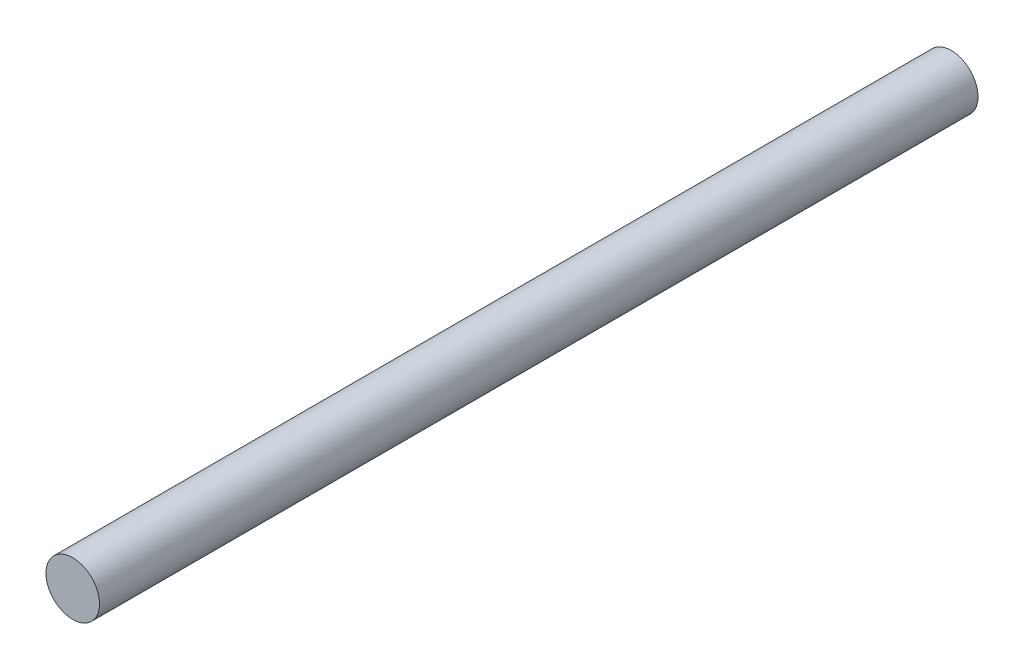
ISO-10303-21;
HEADER;
FILE_DESCRIPTION(('STEP AP214'),'2;1');
FILE_NAME('part.step','',(''),(''),'','','');
FILE_SCHEMA(('AUTOMOTIVE_DESIGN { 1 0 10303 214 1 1 1 1 }'));
ENDSEC;
DATA;
#1=APPLICATION_CONTEXT('core data for automotive mechanical design processes');
#2=APPLICATION_PROTOCOL_DEFINITION('international standard','automotive_design',2000,#1);
#3=PRODUCT_CONTEXT('',#1,'mechanical');
#4=PRODUCT('Part','Part','',(#3));
#5=PRODUCT_RELATED_PRODUCT_CATEGORY('part','',(#4));
#6=PRODUCT_DEFINITION_FORMATION('','',#4);
#7=PRODUCT_DEFINITION_CONTEXT('part definition',#1,'design');
#8=PRODUCT_DEFINITION('design','',#6,#7);
#9=PRODUCT_DEFINITION_SHAPE('','',#8);
#10=(LENGTH_UNIT() NAMED_UNIT(*) SI_UNIT(.MILLI.,.METRE.));
#11=(NAMED_UNIT(*) PLANE_ANGLE_UNIT() SI_UNIT($,.RADIAN.));
#12=(NAMED_UNIT(*) SI_UNIT($,.STERADIAN.) SOLID_ANGLE_UNIT());
#13=UNCERTAINTY_MEASURE_WITH_UNIT(LENGTH_MEASURE(1.E-05),#10,'distance_accuracy_value','');
#14=(GEOMETRIC_REPRESENTATION_CONTEXT(3) GLOBAL_UNCERTAINTY_ASSIGNED_CONTEXT((#13)) GLOBAL_UNIT_ASSIGNED_CONTEXT((#10,
#11,#12)) REPRESENTATION_CONTEXT('',''));
#15=CARTESIAN_POINT('',(0.,0.,0.));
#16=DIRECTION('',(0.,0.,1.));
#17=DIRECTION('',(1.,0.,0.));
#18=AXIS2_PLACEMENT_3D('',#15,#16,#17);
#19=CARTESIAN_POINT('',(0.,0.,52.1));
#20=DIRECTION('',(0.,0.,-1.));
#21=DIRECTION('',(-1.,0.,0.));
#22=AXIS2_PLACEMENT_3D('',#19,#20,#21);
#23=CYLINDRICAL_SURFACE('',#22,1.5875);
#24=CARTESIAN_POINT('',(0.,0.,52.1));
#25=DIRECTION('',(0.,0.,1.));
#26=DIRECTION('',(1.,0.,0.));
#27=AXIS2_PLACEMENT_3D('',#24,#25,#26);
#28=CIRCLE('',#27,1.5875);
#29=CARTESIAN_POINT('',(1.5875,0.,52.1));
#30=VERTEX_POINT('',#29);
#31=EDGE_CURVE('E10',#30,#30,#28,.T.);
#32=ORIENTED_EDGE('',*,*,#31,.F.);
#33=EDGE_LOOP('',(#32));
#34=FACE_BOUND('',#33,.T.);
#35=CARTESIAN_POINT('',(0.,0.,0.));
#36=DIRECTION('',(0.,0.,1.));
#37=DIRECTION('',(1.,0.,0.));
#38=AXIS2_PLACEMENT_3D('',#35,#36,#37);
#39=CIRCLE('',#38,1.5875);
#40=CARTESIAN_POINT('',(1.5875,0.,0.));
#41=VERTEX_POINT('',#40);
#42=EDGE_CURVE('E34',#41,#41,#39,.T.);
#43=ORIENTED_EDGE('',*,*,#42,.T.);
#44=EDGE_LOOP('',(#43));
#45=FACE_BOUND('',#44,.T.);
#46=ADVANCED_FACE('F31',(#34,#45),#23,.T.);
#47=CARTESIAN_POINT('',(0.,0.,52.1));
#48=DIRECTION('',(0.,0.,1.));
#49=DIRECTION('',(1.,0.,0.));
#50=AXIS2_PLACEMENT_3D('',#47,#48,#49);
#51=PLANE('',#50);
#52=ORIENTED_EDGE('',*,*,#31,.T.);
#53=EDGE_LOOP('',(#52));
#54=FACE_BOUND('',#53,.T.);
#55=ADVANCED_FACE('F46',(#54),#51,.T.);
#56=CARTESIAN_POINT('',(0.,0.,0.));
#57=DIRECTION('',(0.,0.,1.));
#58=DIRECTION('',(1.,0.,0.));
#59=AXIS2_PLACEMENT_3D('',#56,#57,#58);
#60=PLANE('',#59);
#61=ORIENTED_EDGE('',*,*,#42,.F.);
#62=EDGE_LOOP('',(#61));
#63=FACE_BOUND('',#62,.T.);
#64=ADVANCED_FACE('F44',(#63),#60,.F.);
#65=CLOSED_SHELL('',(#46,#55,#64));
#66=MANIFOLD_SOLID_BREP('B2',#65);
#67=ADVANCED_BREP_SHAPE_REPRESENTATION('',(#18,#66),#14);
#68=SHAPE_DEFINITION_REPRESENTATION(#9,#67);
ENDSEC;
END-ISO-10303-21;
